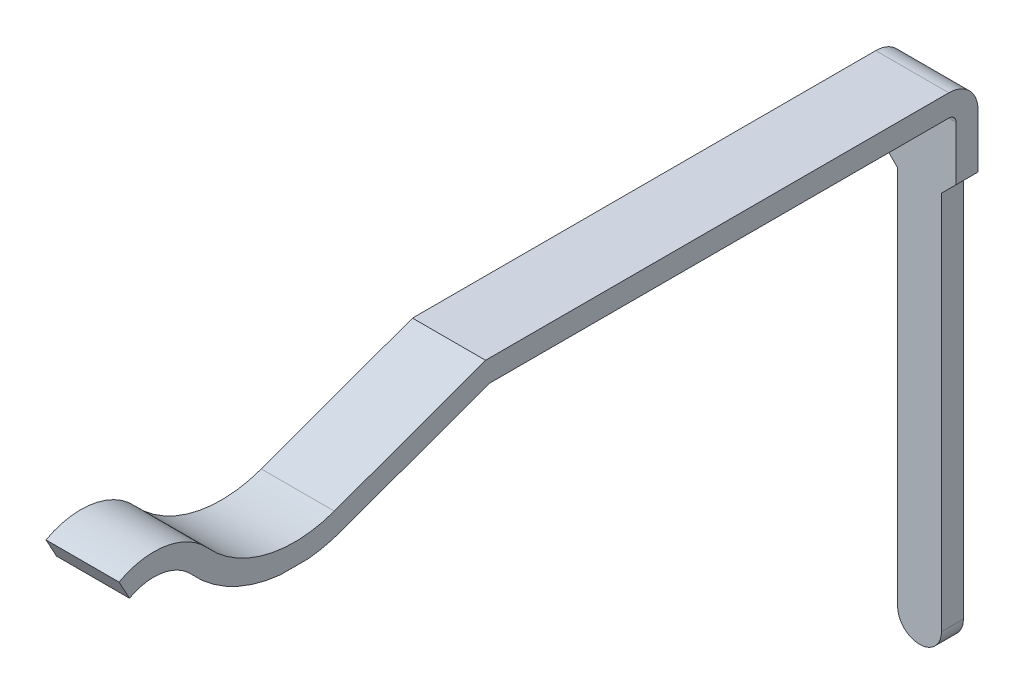
ISO-10303-21;
HEADER;
FILE_DESCRIPTION(('STEP AP214'),'2;1');
FILE_NAME('part.step','',(''),(''),'','','');
FILE_SCHEMA(('AUTOMOTIVE_DESIGN { 1 0 10303 214 1 1 1 1 }'));
ENDSEC;
DATA;
#1=APPLICATION_CONTEXT('core data for automotive mechanical design processes');
#2=APPLICATION_PROTOCOL_DEFINITION('international standard','automotive_design',2000,#1);
#3=PRODUCT_CONTEXT('',#1,'mechanical');
#4=PRODUCT('Part','Part','',(#3));
#5=PRODUCT_RELATED_PRODUCT_CATEGORY('part','',(#4));
#6=PRODUCT_DEFINITION_FORMATION('','',#4);
#7=PRODUCT_DEFINITION_CONTEXT('part definition',#1,'design');
#8=PRODUCT_DEFINITION('design','',#6,#7);
#9=PRODUCT_DEFINITION_SHAPE('','',#8);
#10=(LENGTH_UNIT() NAMED_UNIT(*) SI_UNIT(.MILLI.,.METRE.));
#11=(NAMED_UNIT(*) PLANE_ANGLE_UNIT() SI_UNIT($,.RADIAN.));
#12=(NAMED_UNIT(*) SI_UNIT($,.STERADIAN.) SOLID_ANGLE_UNIT());
#13=UNCERTAINTY_MEASURE_WITH_UNIT(LENGTH_MEASURE(1.E-05),#10,'distance_accuracy_value','');
#14=(GEOMETRIC_REPRESENTATION_CONTEXT(3) GLOBAL_UNCERTAINTY_ASSIGNED_CONTEXT((#13)) GLOBAL_UNIT_ASSIGNED_CONTEXT((#10,
#11,#12)) REPRESENTATION_CONTEXT('',''));
#15=CARTESIAN_POINT('',(0.,0.,0.));
#16=DIRECTION('',(0.,0.,1.));
#17=DIRECTION('',(1.,0.,0.));
#18=AXIS2_PLACEMENT_3D('',#15,#16,#17);
#19=CARTESIAN_POINT('',(0.5,-0.4,-12.46));
#20=DIRECTION('',(0.,0.,-1.));
#21=DIRECTION('',(0.,1.,0.));
#22=AXIS2_PLACEMENT_3D('',#19,#20,#21);
#23=PLANE('',#22);
#24=DIRECTION('',(0.,1.,0.));
#25=VECTOR('',#24,1.);
#26=CARTESIAN_POINT('',(0.3,-0.4,-12.46));
#27=LINE('',#26,#25);
#28=CARTESIAN_POINT('',(0.3,-6.54,-12.46));
#29=VERTEX_POINT('',#28);
#30=CARTESIAN_POINT('',(0.3,-1.34,-12.46));
#31=VERTEX_POINT('',#30);
#32=EDGE_CURVE('E204',#29,#31,#27,.T.);
#33=ORIENTED_EDGE('',*,*,#32,.T.);
#34=DIRECTION('',(0.707106781186551,0.707106781186544,0.));
#35=VECTOR('',#34,1.);
#36=CARTESIAN_POINT('',(0.87,-0.77,-12.46));
#37=LINE('',#36,#35);
#38=CARTESIAN_POINT('',(0.5,-1.14,-12.46));
#39=VERTEX_POINT('',#38);
#40=EDGE_CURVE('E199',#31,#39,#37,.T.);
#41=ORIENTED_EDGE('',*,*,#40,.T.);
#42=DIRECTION('',(0.,-1.,0.));
#43=VECTOR('',#42,1.);
#44=CARTESIAN_POINT('',(0.5,-0.4,-12.46));
#45=LINE('',#44,#43);
#46=CARTESIAN_POINT('',(0.5,-0.4,-12.46));
#47=VERTEX_POINT('',#46);
#48=EDGE_CURVE('E209',#47,#39,#45,.T.);
#49=ORIENTED_EDGE('',*,*,#48,.F.);
#50=DIRECTION('',(-1.,0.,0.));
#51=VECTOR('',#50,1.);
#52=CARTESIAN_POINT('',(0.5,-0.4,-12.46));
#53=LINE('',#52,#51);
#54=CARTESIAN_POINT('',(-0.5,-0.4,-12.46));
#55=VERTEX_POINT('',#54);
#56=EDGE_CURVE('E246',#47,#55,#53,.T.);
#57=ORIENTED_EDGE('',*,*,#56,.T.);
#58=DIRECTION('',(0.,-1.,0.));
#59=VECTOR('',#58,1.);
#60=CARTESIAN_POINT('',(-0.5,-0.4,-12.46));
#61=LINE('',#60,#59);
#62=CARTESIAN_POINT('',(-0.5,-1.14,-12.46));
#63=VERTEX_POINT('',#62);
#64=EDGE_CURVE('E208',#55,#63,#61,.T.);
#65=ORIENTED_EDGE('',*,*,#64,.T.);
#66=DIRECTION('',(0.707106781186544,-0.707106781186552,0.));
#67=VECTOR('',#66,1.);
#68=CARTESIAN_POINT('',(-0.370000000000004,-1.27,-12.46));
#69=LINE('',#68,#67);
#70=CARTESIAN_POINT('',(-0.3,-1.34,-12.46));
#71=VERTEX_POINT('',#70);
#72=EDGE_CURVE('E195',#63,#71,#69,.T.);
#73=ORIENTED_EDGE('',*,*,#72,.T.);
#74=DIRECTION('',(0.,-1.,0.));
#75=VECTOR('',#74,1.);
#76=CARTESIAN_POINT('',(-0.3,-0.4,-12.46));
#77=LINE('',#76,#75);
#78=CARTESIAN_POINT('',(-0.3,-6.54,-12.46));
#79=VERTEX_POINT('',#78);
#80=EDGE_CURVE('E202',#71,#79,#77,.T.);
#81=ORIENTED_EDGE('',*,*,#80,.T.);
#82=CARTESIAN_POINT('',(0.,-6.54,-12.46));
#83=DIRECTION('',(0.,0.,-1.));
#84=DIRECTION('',(0.,1.,0.));
#85=AXIS2_PLACEMENT_3D('',#82,#83,#84);
#86=CIRCLE('',#85,0.3);
#87=EDGE_CURVE('E158',#79,#29,#86,.F.);
#88=ORIENTED_EDGE('',*,*,#87,.T.);
#89=EDGE_LOOP('',(#33,#41,#49,#57,#65,#73,#81,#88));
#90=FACE_BOUND('',#89,.T.);
#91=ADVANCED_FACE('F17',(#90),#23,.F.);
#92=CARTESIAN_POINT('',(0.5,-0.4,-12.76));
#93=DIRECTION('',(0.,0.,-1.));
#94=DIRECTION('',(0.,1.,0.));
#95=AXIS2_PLACEMENT_3D('',#92,#93,#94);
#96=PLANE('',#95);
#97=DIRECTION('',(-0.707106781186551,-0.707106781186544,0.));
#98=VECTOR('',#97,1.);
#99=CARTESIAN_POINT('',(0.5,-1.14,-12.76));
#100=LINE('',#99,#98);
#101=CARTESIAN_POINT('',(0.5,-1.14,-12.76));
#102=VERTEX_POINT('',#101);
#103=CARTESIAN_POINT('',(0.3,-1.34,-12.76));
#104=VERTEX_POINT('',#103);
#105=EDGE_CURVE('E180',#102,#104,#100,.T.);
#106=ORIENTED_EDGE('',*,*,#105,.T.);
#107=DIRECTION('',(0.,-1.,0.));
#108=VECTOR('',#107,1.);
#109=CARTESIAN_POINT('',(0.3,-1.34,-12.76));
#110=LINE('',#109,#108);
#111=CARTESIAN_POINT('',(0.3,-6.54,-12.76));
#112=VERTEX_POINT('',#111);
#113=EDGE_CURVE('E162',#104,#112,#110,.T.);
#114=ORIENTED_EDGE('',*,*,#113,.T.);
#115=CARTESIAN_POINT('',(0.,-6.54,-12.76));
#116=DIRECTION('',(0.,0.,-1.));
#117=DIRECTION('',(1.,0.,0.));
#118=AXIS2_PLACEMENT_3D('',#115,#116,#117);
#119=CIRCLE('',#118,0.3);
#120=CARTESIAN_POINT('',(-0.3,-6.54,-12.76));
#121=VERTEX_POINT('',#120);
#122=EDGE_CURVE('E156',#112,#121,#119,.T.);
#123=ORIENTED_EDGE('',*,*,#122,.T.);
#124=DIRECTION('',(0.,1.,0.));
#125=VECTOR('',#124,1.);
#126=CARTESIAN_POINT('',(-0.3,-6.54,-12.76));
#127=LINE('',#126,#125);
#128=CARTESIAN_POINT('',(-0.3,-1.34,-12.76));
#129=VERTEX_POINT('',#128);
#130=EDGE_CURVE('E165',#121,#129,#127,.T.);
#131=ORIENTED_EDGE('',*,*,#130,.T.);
#132=DIRECTION('',(-0.707106781186544,0.707106781186551,0.));
#133=VECTOR('',#132,1.);
#134=CARTESIAN_POINT('',(-0.3,-1.34,-12.76));
#135=LINE('',#134,#133);
#136=CARTESIAN_POINT('',(-0.5,-1.14,-12.76));
#137=VERTEX_POINT('',#136);
#138=EDGE_CURVE('E171',#129,#137,#135,.T.);
#139=ORIENTED_EDGE('',*,*,#138,.T.);
#140=DIRECTION('',(0.,-1.,0.));
#141=VECTOR('',#140,1.);
#142=CARTESIAN_POINT('',(-0.5,-0.4,-12.76));
#143=LINE('',#142,#141);
#144=CARTESIAN_POINT('',(-0.5,-0.4,-12.76));
#145=VERTEX_POINT('',#144);
#146=EDGE_CURVE('E249',#145,#137,#143,.T.);
#147=ORIENTED_EDGE('',*,*,#146,.F.);
#148=DIRECTION('',(-1.,0.,0.));
#149=VECTOR('',#148,1.);
#150=CARTESIAN_POINT('',(0.5,-0.4,-12.76));
#151=LINE('',#150,#149);
#152=CARTESIAN_POINT('',(0.5,-0.4,-12.76));
#153=VERTEX_POINT('',#152);
#154=EDGE_CURVE('E307',#153,#145,#151,.T.);
#155=ORIENTED_EDGE('',*,*,#154,.F.);
#156=DIRECTION('',(0.,-1.,0.));
#157=VECTOR('',#156,1.);
#158=CARTESIAN_POINT('',(0.5,-0.4,-12.76));
#159=LINE('',#158,#157);
#160=EDGE_CURVE('E212',#153,#102,#159,.T.);
#161=ORIENTED_EDGE('',*,*,#160,.T.);
#162=EDGE_LOOP('',(#106,#114,#123,#131,#139,#147,#155,#161));
#163=FACE_BOUND('',#162,.T.);
#164=ADVANCED_FACE('F175',(#163),#96,.T.);
#165=CARTESIAN_POINT('',(0.5,-0.4,-12.36));
#166=DIRECTION('',(-1.,0.,0.));
#167=DIRECTION('',(0.,0.,1.));
#168=AXIS2_PLACEMENT_3D('',#165,#166,#167);
#169=CYLINDRICAL_SURFACE('',#168,0.4);
#170=CARTESIAN_POINT('',(-0.5,-0.4,-12.36));
#171=DIRECTION('',(-1.,0.,0.));
#172=DIRECTION('',(0.,0.,1.));
#173=AXIS2_PLACEMENT_3D('',#170,#171,#172);
#174=CIRCLE('',#173,0.4);
#175=CARTESIAN_POINT('',(-0.5,0.,-12.36));
#176=VERTEX_POINT('',#175);
#177=EDGE_CURVE('E252',#176,#145,#174,.T.);
#178=ORIENTED_EDGE('',*,*,#177,.F.);
#179=DIRECTION('',(-1.,0.,0.));
#180=VECTOR('',#179,1.);
#181=CARTESIAN_POINT('',(0.5,0.,-12.36));
#182=LINE('',#181,#180);
#183=CARTESIAN_POINT('',(0.5,0.,-12.36));
#184=VERTEX_POINT('',#183);
#185=EDGE_CURVE('E305',#184,#176,#182,.T.);
#186=ORIENTED_EDGE('',*,*,#185,.F.);
#187=CARTESIAN_POINT('',(0.5,-0.4,-12.36));
#188=DIRECTION('',(-1.,0.,0.));
#189=DIRECTION('',(0.,0.,1.));
#190=AXIS2_PLACEMENT_3D('',#187,#188,#189);
#191=CIRCLE('',#190,0.4);
#192=EDGE_CURVE('E216',#184,#153,#191,.T.);
#193=ORIENTED_EDGE('',*,*,#192,.T.);
#194=ORIENTED_EDGE('',*,*,#154,.T.);
#195=EDGE_LOOP('',(#178,#186,#193,#194));
#196=FACE_BOUND('',#195,.T.);
#197=ADVANCED_FACE('F361',(#196),#169,.T.);
#198=CARTESIAN_POINT('',(0.5,0.,-6.01747897566997));
#199=DIRECTION('',(0.,1.,0.));
#200=DIRECTION('',(0.,0.,1.));
#201=AXIS2_PLACEMENT_3D('',#198,#199,#200);
#202=PLANE('',#201);
#203=DIRECTION('',(0.,0.,-1.));
#204=VECTOR('',#203,1.);
#205=CARTESIAN_POINT('',(-0.5,0.,-6.01747897566997));
#206=LINE('',#205,#204);
#207=CARTESIAN_POINT('',(-0.5,0.,-6.01747897566997));
#208=VERTEX_POINT('',#207);
#209=EDGE_CURVE('E255',#208,#176,#206,.T.);
#210=ORIENTED_EDGE('',*,*,#209,.F.);
#211=DIRECTION('',(-1.,0.,0.));
#212=VECTOR('',#211,1.);
#213=CARTESIAN_POINT('',(0.5,0.,-6.01747897566997));
#214=LINE('',#213,#212);
#215=CARTESIAN_POINT('',(0.5,0.,-6.01747897566997));
#216=VERTEX_POINT('',#215);
#217=EDGE_CURVE('E303',#216,#208,#214,.T.);
#218=ORIENTED_EDGE('',*,*,#217,.F.);
#219=DIRECTION('',(0.,0.,-1.));
#220=VECTOR('',#219,1.);
#221=CARTESIAN_POINT('',(0.5,0.,-6.01747897566997));
#222=LINE('',#221,#220);
#223=EDGE_CURVE('E219',#216,#184,#222,.T.);
#224=ORIENTED_EDGE('',*,*,#223,.T.);
#225=ORIENTED_EDGE('',*,*,#185,.T.);
#226=EDGE_LOOP('',(#210,#218,#224,#225));
#227=FACE_BOUND('',#226,.T.);
#228=ADVANCED_FACE('F357',(#227),#202,.T.);
#229=CARTESIAN_POINT('',(0.5,0.,-6.01747897566997));
#230=DIRECTION('',(0.,0.939692620785908,0.342020143325669));
#231=DIRECTION('',(0.,-0.342020143325669,0.939692620785908));
#232=AXIS2_PLACEMENT_3D('',#229,#230,#231);
#233=PLANE('',#232);
#234=DIRECTION('',(0.,0.342020143325669,-0.939692620785908));
#235=VECTOR('',#234,1.);
#236=CARTESIAN_POINT('',(-0.5,0.,-6.01747897566997));
#237=LINE('',#236,#235);
#238=CARTESIAN_POINT('',(-0.5,-0.753508193257452,-3.94723222932108));
#239=VERTEX_POINT('',#238);
#240=EDGE_CURVE('E258',#239,#208,#237,.T.);
#241=ORIENTED_EDGE('',*,*,#240,.F.);
#242=DIRECTION('',(-1.,0.,0.));
#243=VECTOR('',#242,1.);
#244=CARTESIAN_POINT('',(0.5,-0.753508193257452,-3.94723222932108));
#245=LINE('',#244,#243);
#246=CARTESIAN_POINT('',(0.5,-0.753508193257452,-3.94723222932108));
#247=VERTEX_POINT('',#246);
#248=EDGE_CURVE('E301',#247,#239,#245,.T.);
#249=ORIENTED_EDGE('',*,*,#248,.F.);
#250=DIRECTION('',(0.,0.342020143325669,-0.939692620785908));
#251=VECTOR('',#250,1.);
#252=CARTESIAN_POINT('',(0.5,0.,-6.01747897566997));
#253=LINE('',#252,#251);
#254=EDGE_CURVE('E222',#247,#216,#253,.T.);
#255=ORIENTED_EDGE('',*,*,#254,.T.);
#256=ORIENTED_EDGE('',*,*,#217,.T.);
#257=EDGE_LOOP('',(#241,#249,#255,#256));
#258=FACE_BOUND('',#257,.T.);
#259=ADVANCED_FACE('F353',(#258),#233,.T.);
#260=CARTESIAN_POINT('',(0.5,0.75,-3.4));
#261=DIRECTION('',(-1.,0.,0.));
#262=DIRECTION('',(0.,0.,1.));
#263=AXIS2_PLACEMENT_3D('',#260,#261,#262);
#264=CYLINDRICAL_SURFACE('',#263,1.6);
#265=CARTESIAN_POINT('',(-0.5,0.75,-3.4));
#266=DIRECTION('',(1.,0.,0.));
#267=DIRECTION('',(0.,0.,1.));
#268=AXIS2_PLACEMENT_3D('',#265,#266,#267);
#269=CIRCLE('',#268,1.6);
#270=CARTESIAN_POINT('',(-0.5,-0.326923076923077,-2.21668402935204));
#271=VERTEX_POINT('',#270);
#272=EDGE_CURVE('E261',#271,#239,#269,.T.);
#273=ORIENTED_EDGE('',*,*,#272,.F.);
#274=DIRECTION('',(-1.,0.,0.));
#275=VECTOR('',#274,1.);
#276=CARTESIAN_POINT('',(0.5,-0.326923076923077,-2.21668402935204));
#277=LINE('',#276,#275);
#278=CARTESIAN_POINT('',(0.5,-0.326923076923077,-2.21668402935204));
#279=VERTEX_POINT('',#278);
#280=EDGE_CURVE('E299',#279,#271,#277,.T.);
#281=ORIENTED_EDGE('',*,*,#280,.F.);
#282=CARTESIAN_POINT('',(0.5,0.75,-3.4));
#283=DIRECTION('',(1.,0.,0.));
#284=DIRECTION('',(0.,0.,1.));
#285=AXIS2_PLACEMENT_3D('',#282,#283,#284);
#286=CIRCLE('',#285,1.6);
#287=EDGE_CURVE('E225',#279,#247,#286,.T.);
#288=ORIENTED_EDGE('',*,*,#287,.T.);
#289=ORIENTED_EDGE('',*,*,#248,.T.);
#290=EDGE_LOOP('',(#273,#281,#288,#289));
#291=FACE_BOUND('',#290,.T.);
#292=ADVANCED_FACE('F349',(#291),#264,.F.);
#293=CARTESIAN_POINT('',(0.5,-1.,-1.47711154769706));
#294=DIRECTION('',(-1.,0.,0.));
#295=DIRECTION('',(0.,0.,1.));
#296=AXIS2_PLACEMENT_3D('',#293,#294,#295);
#297=CYLINDRICAL_SURFACE('',#296,1.);
#298=CARTESIAN_POINT('',(-0.5,-1.,-1.47711154769706));
#299=DIRECTION('',(-1.,0.,0.));
#300=DIRECTION('',(0.,0.,-1.));
#301=AXIS2_PLACEMENT_3D('',#298,#299,#300);
#302=CIRCLE('',#301,1.);
#303=CARTESIAN_POINT('',(-0.5,-0.121157254650118,-1.));
#304=VERTEX_POINT('',#303);
#305=EDGE_CURVE('E264',#304,#271,#302,.T.);
#306=ORIENTED_EDGE('',*,*,#305,.F.);
#307=DIRECTION('',(-1.,0.,0.));
#308=VECTOR('',#307,1.);
#309=CARTESIAN_POINT('',(0.5,-0.121157254650118,-1.));
#310=LINE('',#309,#308);
#311=CARTESIAN_POINT('',(0.5,-0.121157254650118,-1.));
#312=VERTEX_POINT('',#311);
#313=EDGE_CURVE('E297',#312,#304,#310,.T.);
#314=ORIENTED_EDGE('',*,*,#313,.F.);
#315=CARTESIAN_POINT('',(0.5,-1.,-1.47711154769706));
#316=DIRECTION('',(-1.,0.,0.));
#317=DIRECTION('',(0.,0.,-1.));
#318=AXIS2_PLACEMENT_3D('',#315,#316,#317);
#319=CIRCLE('',#318,1.);
#320=EDGE_CURVE('E228',#312,#279,#319,.T.);
#321=ORIENTED_EDGE('',*,*,#320,.T.);
#322=ORIENTED_EDGE('',*,*,#280,.T.);
#323=EDGE_LOOP('',(#306,#314,#321,#322));
#324=FACE_BOUND('',#323,.T.);
#325=ADVANCED_FACE('F345',(#324),#297,.T.);
#326=CARTESIAN_POINT('',(0.5,-0.384810078255083,-1.14313346430912));
#327=DIRECTION('',(0.,-0.477111547697059,0.878842745349882));
#328=DIRECTION('',(0.,-0.878842745349882,-0.477111547697059));
#329=AXIS2_PLACEMENT_3D('',#326,#327,#328);
#330=PLANE('',#329);
#331=DIRECTION('',(0.,0.878842745349882,0.477111547697059));
#332=VECTOR('',#331,1.);
#333=CARTESIAN_POINT('',(-0.5,-0.384810078255083,-1.14313346430912));
#334=LINE('',#333,#332);
#335=CARTESIAN_POINT('',(-0.5,-0.384810078255083,-1.14313346430912));
#336=VERTEX_POINT('',#335);
#337=EDGE_CURVE('E267',#336,#304,#334,.T.);
#338=ORIENTED_EDGE('',*,*,#337,.F.);
#339=DIRECTION('',(-1.,0.,0.));
#340=VECTOR('',#339,1.);
#341=CARTESIAN_POINT('',(0.5,-0.384810078255083,-1.14313346430912));
#342=LINE('',#341,#340);
#343=CARTESIAN_POINT('',(0.5,-0.384810078255083,-1.14313346430912));
#344=VERTEX_POINT('',#343);
#345=EDGE_CURVE('E295',#344,#336,#342,.T.);
#346=ORIENTED_EDGE('',*,*,#345,.F.);
#347=DIRECTION('',(0.,0.878842745349882,0.477111547697059));
#348=VECTOR('',#347,1.);
#349=CARTESIAN_POINT('',(0.5,-0.384810078255083,-1.14313346430912));
#350=LINE('',#349,#348);
#351=EDGE_CURVE('E231',#344,#312,#350,.T.);
#352=ORIENTED_EDGE('',*,*,#351,.T.);
#353=ORIENTED_EDGE('',*,*,#313,.T.);
#354=EDGE_LOOP('',(#338,#346,#352,#353));
#355=FACE_BOUND('',#354,.T.);
#356=ADVANCED_FACE('F342',(#355),#330,.T.);
#357=CARTESIAN_POINT('',(0.5,-1.,-1.47711154769706));
#358=DIRECTION('',(-1.,0.,0.));
#359=DIRECTION('',(0.,0.,1.));
#360=AXIS2_PLACEMENT_3D('',#357,#358,#359);
#361=CYLINDRICAL_SURFACE('',#360,0.7);
#362=CARTESIAN_POINT('',(-0.5,-1.,-1.47711154769706));
#363=DIRECTION('',(1.,0.,0.));
#364=DIRECTION('',(0.,0.,-1.));
#365=AXIS2_PLACEMENT_3D('',#362,#363,#364);
#366=CIRCLE('',#365,0.7);
#367=CARTESIAN_POINT('',(-0.5,-0.528846153846154,-1.99481228485554));
#368=VERTEX_POINT('',#367);
#369=EDGE_CURVE('E270',#336,#368,#366,.F.);
#370=ORIENTED_EDGE('',*,*,#369,.T.);
#371=DIRECTION('',(-1.,0.,0.));
#372=VECTOR('',#371,1.);
#373=CARTESIAN_POINT('',(0.5,-0.528846153846154,-1.99481228485554));
#374=LINE('',#373,#372);
#375=CARTESIAN_POINT('',(0.5,-0.528846153846154,-1.99481228485554));
#376=VERTEX_POINT('',#375);
#377=EDGE_CURVE('E292',#376,#368,#374,.T.);
#378=ORIENTED_EDGE('',*,*,#377,.F.);
#379=CARTESIAN_POINT('',(0.5,-1.,-1.47711154769706));
#380=DIRECTION('',(1.,0.,0.));
#381=DIRECTION('',(0.,0.,-1.));
#382=AXIS2_PLACEMENT_3D('',#379,#380,#381);
#383=CIRCLE('',#382,0.7);
#384=EDGE_CURVE('E234',#344,#376,#383,.F.);
#385=ORIENTED_EDGE('',*,*,#384,.F.);
#386=ORIENTED_EDGE('',*,*,#345,.T.);
#387=EDGE_LOOP('',(#370,#378,#385,#386));
#388=FACE_BOUND('',#387,.T.);
#389=ADVANCED_FACE('F338',(#388),#361,.F.);
#390=CARTESIAN_POINT('',(0.5,0.75,-3.4));
#391=DIRECTION('',(-1.,0.,0.));
#392=DIRECTION('',(0.,0.,1.));
#393=AXIS2_PLACEMENT_3D('',#390,#391,#392);
#394=CYLINDRICAL_SURFACE('',#393,1.9);
#395=CARTESIAN_POINT('',(0.5,0.75,-3.4));
#396=DIRECTION('',(1.,0.,0.));
#397=DIRECTION('',(0.,0.,-1.));
#398=AXIS2_PLACEMENT_3D('',#395,#396,#397);
#399=CIRCLE('',#398,1.9);
#400=CARTESIAN_POINT('',(0.5,-1.14,-3.59467922333929));
#401=VERTEX_POINT('',#400);
#402=CARTESIAN_POINT('',(0.5,-1.03541597949322,-4.04983827231877));
#403=VERTEX_POINT('',#402);
#404=EDGE_CURVE('E236',#401,#403,#399,.T.);
#405=ORIENTED_EDGE('',*,*,#404,.F.);
#406=CARTESIAN_POINT('',(2.39000000000003,0.75,-3.4));
#407=DIRECTION('',(-0.707106781186544,0.707106781186551,0.));
#408=DIRECTION('',(-0.707106781186551,-0.707106781186544,0.));
#409=AXIS2_PLACEMENT_3D('',#406,#407,#408);
#410=ELLIPSE('',#409,2.6870057685089,1.9);
#411=CARTESIAN_POINT('',(0.5,-1.14,-3.20532077666071));
#412=VERTEX_POINT('',#411);
#413=EDGE_CURVE('E30',#401,#412,#410,.T.);
#414=ORIENTED_EDGE('',*,*,#413,.T.);
#415=EDGE_CURVE('E237',#376,#412,#399,.T.);
#416=ORIENTED_EDGE('',*,*,#415,.F.);
#417=ORIENTED_EDGE('',*,*,#377,.T.);
#418=CARTESIAN_POINT('',(-0.5,0.75,-3.4));
#419=DIRECTION('',(1.,0.,0.));
#420=DIRECTION('',(0.,0.,-1.));
#421=AXIS2_PLACEMENT_3D('',#418,#419,#420);
#422=CIRCLE('',#421,1.9);
#423=CARTESIAN_POINT('',(-0.5,-1.14,-3.20532077666066));
#424=VERTEX_POINT('',#423);
#425=EDGE_CURVE('E273',#368,#424,#422,.T.);
#426=ORIENTED_EDGE('',*,*,#425,.T.);
#427=CARTESIAN_POINT('',(-2.39,0.75,-3.4));
#428=DIRECTION('',(0.707106781186552,0.707106781186544,0.));
#429=DIRECTION('',(-0.707106781186544,0.707106781186552,0.));
#430=AXIS2_PLACEMENT_3D('',#427,#428,#429);
#431=ELLIPSE('',#430,2.68700576850887,1.9);
#432=CARTESIAN_POINT('',(-0.5,-1.14,-3.59467922333934));
#433=VERTEX_POINT('',#432);
#434=EDGE_CURVE('E36',#424,#433,#431,.T.);
#435=ORIENTED_EDGE('',*,*,#434,.T.);
#436=CARTESIAN_POINT('',(-0.5,-1.03541597949322,-4.04983827231877));
#437=VERTEX_POINT('',#436);
#438=EDGE_CURVE('E272',#433,#437,#422,.T.);
#439=ORIENTED_EDGE('',*,*,#438,.T.);
#440=DIRECTION('',(-1.,0.,0.));
#441=VECTOR('',#440,1.);
#442=CARTESIAN_POINT('',(0.5,-1.03541597949322,-4.04983827231877));
#443=LINE('',#442,#441);
#444=EDGE_CURVE('E289',#403,#437,#443,.T.);
#445=ORIENTED_EDGE('',*,*,#444,.F.);
#446=EDGE_LOOP('',(#405,#414,#416,#417,#426,#435,#439,#445));
#447=FACE_BOUND('',#446,.T.);
#448=ADVANCED_FACE('F314',(#447),#394,.T.);
#449=CARTESIAN_POINT('',(0.5,-0.281907786235773,-6.12008501866767));
#450=DIRECTION('',(0.,0.939692620785908,0.342020143325669));
#451=DIRECTION('',(0.,-0.342020143325669,0.939692620785908));
#452=AXIS2_PLACEMENT_3D('',#449,#450,#451);
#453=PLANE('',#452);
#454=DIRECTION('',(0.,0.342020143325669,-0.939692620785908));
#455=VECTOR('',#454,1.);
#456=CARTESIAN_POINT('',(-0.5,-0.281907786235773,-6.12008501866767));
#457=LINE('',#456,#455);
#458=CARTESIAN_POINT('',(-0.5,-0.3,-6.07037706988251));
#459=VERTEX_POINT('',#458);
#460=EDGE_CURVE('E276',#437,#459,#457,.T.);
#461=ORIENTED_EDGE('',*,*,#460,.T.);
#462=DIRECTION('',(-1.,0.,0.));
#463=VECTOR('',#462,1.);
#464=CARTESIAN_POINT('',(0.5,-0.3,-6.07037706988251));
#465=LINE('',#464,#463);
#466=CARTESIAN_POINT('',(0.5,-0.3,-6.07037706988251));
#467=VERTEX_POINT('',#466);
#468=EDGE_CURVE('E286',#467,#459,#465,.T.);
#469=ORIENTED_EDGE('',*,*,#468,.F.);
#470=DIRECTION('',(0.,0.342020143325669,-0.939692620785908));
#471=VECTOR('',#470,1.);
#472=CARTESIAN_POINT('',(0.5,-0.281907786235773,-6.12008501866767));
#473=LINE('',#472,#471);
#474=EDGE_CURVE('E240',#403,#467,#473,.T.);
#475=ORIENTED_EDGE('',*,*,#474,.F.);
#476=ORIENTED_EDGE('',*,*,#444,.T.);
#477=EDGE_LOOP('',(#461,#469,#475,#476));
#478=FACE_BOUND('',#477,.T.);
#479=ADVANCED_FACE('F322',(#478),#453,.F.);
#480=CARTESIAN_POINT('',(0.5,-0.3,-6.01747897566997));
#481=DIRECTION('',(0.,1.,0.));
#482=DIRECTION('',(0.,0.,1.));
#483=AXIS2_PLACEMENT_3D('',#480,#481,#482);
#484=PLANE('',#483);
#485=DIRECTION('',(0.,0.,-1.));
#486=VECTOR('',#485,1.);
#487=CARTESIAN_POINT('',(-0.5,-0.3,-6.01747897566997));
#488=LINE('',#487,#486);
#489=CARTESIAN_POINT('',(-0.5,-0.3,-12.36));
#490=VERTEX_POINT('',#489);
#491=EDGE_CURVE('E278',#459,#490,#488,.T.);
#492=ORIENTED_EDGE('',*,*,#491,.T.);
#493=DIRECTION('',(-1.,0.,0.));
#494=VECTOR('',#493,1.);
#495=CARTESIAN_POINT('',(0.5,-0.3,-12.36));
#496=LINE('',#495,#494);
#497=CARTESIAN_POINT('',(0.5,-0.3,-12.36));
#498=VERTEX_POINT('',#497);
#499=EDGE_CURVE('E283',#498,#490,#496,.T.);
#500=ORIENTED_EDGE('',*,*,#499,.F.);
#501=DIRECTION('',(0.,0.,-1.));
#502=VECTOR('',#501,1.);
#503=CARTESIAN_POINT('',(0.5,-0.3,-6.01747897566997));
#504=LINE('',#503,#502);
#505=EDGE_CURVE('E242',#467,#498,#504,.T.);
#506=ORIENTED_EDGE('',*,*,#505,.F.);
#507=ORIENTED_EDGE('',*,*,#468,.T.);
#508=EDGE_LOOP('',(#492,#500,#506,#507));
#509=FACE_BOUND('',#508,.T.);
#510=ADVANCED_FACE('F326',(#509),#484,.F.);
#511=CARTESIAN_POINT('',(0.5,-0.4,-12.36));
#512=DIRECTION('',(-1.,0.,0.));
#513=DIRECTION('',(0.,0.,1.));
#514=AXIS2_PLACEMENT_3D('',#511,#512,#513);
#515=CYLINDRICAL_SURFACE('',#514,0.1);
#516=CARTESIAN_POINT('',(-0.5,-0.4,-12.36));
#517=DIRECTION('',(1.,0.,0.));
#518=DIRECTION('',(0.,0.,-1.));
#519=AXIS2_PLACEMENT_3D('',#516,#517,#518);
#520=CIRCLE('',#519,0.1);
#521=EDGE_CURVE('E213',#490,#55,#520,.F.);
#522=ORIENTED_EDGE('',*,*,#521,.T.);
#523=ORIENTED_EDGE('',*,*,#56,.F.);
#524=CARTESIAN_POINT('',(0.5,-0.4,-12.36));
#525=DIRECTION('',(1.,0.,0.));
#526=DIRECTION('',(0.,0.,-1.));
#527=AXIS2_PLACEMENT_3D('',#524,#525,#526);
#528=CIRCLE('',#527,0.1);
#529=EDGE_CURVE('E244',#498,#47,#528,.F.);
#530=ORIENTED_EDGE('',*,*,#529,.F.);
#531=ORIENTED_EDGE('',*,*,#499,.T.);
#532=EDGE_LOOP('',(#522,#523,#530,#531));
#533=FACE_BOUND('',#532,.T.);
#534=ADVANCED_FACE('F370',(#533),#515,.F.);
#535=CARTESIAN_POINT('',(0.5,-0.4,-12.36));
#536=DIRECTION('',(-1.,0.,0.));
#537=DIRECTION('',(0.,0.,1.));
#538=AXIS2_PLACEMENT_3D('',#535,#536,#537);
#539=PLANE('',#538);
#540=ORIENTED_EDGE('',*,*,#415,.T.);
#541=DIRECTION('',(0.,0.,-1.));
#542=VECTOR('',#541,1.);
#543=CARTESIAN_POINT('',(0.5,-1.14,-12.36));
#544=LINE('',#543,#542);
#545=EDGE_CURVE('E11',#412,#401,#544,.T.);
#546=ORIENTED_EDGE('',*,*,#545,.T.);
#547=ORIENTED_EDGE('',*,*,#404,.T.);
#548=ORIENTED_EDGE('',*,*,#474,.T.);
#549=ORIENTED_EDGE('',*,*,#505,.T.);
#550=ORIENTED_EDGE('',*,*,#529,.T.);
#551=ORIENTED_EDGE('',*,*,#48,.T.);
#552=DIRECTION('',(0.,0.,1.));
#553=VECTOR('',#552,1.);
#554=CARTESIAN_POINT('',(0.5,-1.14,-12.76));
#555=LINE('',#554,#553);
#556=EDGE_CURVE('E188',#102,#39,#555,.T.);
#557=ORIENTED_EDGE('',*,*,#556,.F.);
#558=ORIENTED_EDGE('',*,*,#160,.F.);
#559=ORIENTED_EDGE('',*,*,#192,.F.);
#560=ORIENTED_EDGE('',*,*,#223,.F.);
#561=ORIENTED_EDGE('',*,*,#254,.F.);
#562=ORIENTED_EDGE('',*,*,#287,.F.);
#563=ORIENTED_EDGE('',*,*,#320,.F.);
#564=ORIENTED_EDGE('',*,*,#351,.F.);
#565=ORIENTED_EDGE('',*,*,#384,.T.);
#566=EDGE_LOOP('',(#540,#546,#547,#548,#549,#550,#551,#557,#558,#559,#560,#561,#562,#563,#564,#565));
#567=FACE_BOUND('',#566,.T.);
#568=ADVANCED_FACE('F330',(#567),#539,.F.);
#569=CARTESIAN_POINT('',(-0.5,-0.4,-12.36));
#570=DIRECTION('',(-1.,0.,0.));
#571=DIRECTION('',(0.,0.,1.));
#572=AXIS2_PLACEMENT_3D('',#569,#570,#571);
#573=PLANE('',#572);
#574=DIRECTION('',(0.,0.,-1.));
#575=VECTOR('',#574,1.);
#576=CARTESIAN_POINT('',(-0.5,-1.14,-12.36));
#577=LINE('',#576,#575);
#578=EDGE_CURVE('E24',#424,#433,#577,.T.);
#579=ORIENTED_EDGE('',*,*,#578,.F.);
#580=ORIENTED_EDGE('',*,*,#425,.F.);
#581=ORIENTED_EDGE('',*,*,#369,.F.);
#582=ORIENTED_EDGE('',*,*,#337,.T.);
#583=ORIENTED_EDGE('',*,*,#305,.T.);
#584=ORIENTED_EDGE('',*,*,#272,.T.);
#585=ORIENTED_EDGE('',*,*,#240,.T.);
#586=ORIENTED_EDGE('',*,*,#209,.T.);
#587=ORIENTED_EDGE('',*,*,#177,.T.);
#588=ORIENTED_EDGE('',*,*,#146,.T.);
#589=DIRECTION('',(0.,0.,1.));
#590=VECTOR('',#589,1.);
#591=CARTESIAN_POINT('',(-0.5,-1.14,-12.76));
#592=LINE('',#591,#590);
#593=EDGE_CURVE('E190',#137,#63,#592,.T.);
#594=ORIENTED_EDGE('',*,*,#593,.T.);
#595=ORIENTED_EDGE('',*,*,#64,.F.);
#596=ORIENTED_EDGE('',*,*,#521,.F.);
#597=ORIENTED_EDGE('',*,*,#491,.F.);
#598=ORIENTED_EDGE('',*,*,#460,.F.);
#599=ORIENTED_EDGE('',*,*,#438,.F.);
#600=EDGE_LOOP('',(#579,#580,#581,#582,#583,#584,#585,#586,#587,#588,#594,#595,#596,#597,#598,#599));
#601=FACE_BOUND('',#600,.T.);
#602=ADVANCED_FACE('F317',(#601),#573,.T.);
#603=CARTESIAN_POINT('',(0.5,-1.14,-12.76));
#604=DIRECTION('',(-0.707106781186544,0.707106781186551,0.));
#605=DIRECTION('',(-0.707106781186551,-0.707106781186544,0.));
#606=AXIS2_PLACEMENT_3D('',#603,#604,#605);
#607=PLANE('',#606);
#608=DIRECTION('',(0.,0.,1.));
#609=VECTOR('',#608,1.);
#610=CARTESIAN_POINT('',(0.3,-1.34,-12.76));
#611=LINE('',#610,#609);
#612=EDGE_CURVE('E185',#104,#31,#611,.T.);
#613=ORIENTED_EDGE('',*,*,#612,.F.);
#614=ORIENTED_EDGE('',*,*,#105,.F.);
#615=ORIENTED_EDGE('',*,*,#556,.T.);
#616=ORIENTED_EDGE('',*,*,#40,.F.);
#617=EDGE_LOOP('',(#613,#614,#615,#616));
#618=FACE_BOUND('',#617,.T.);
#619=ADVANCED_FACE('F440',(#618),#607,.F.);
#620=CARTESIAN_POINT('',(0.3,-1.34,-12.76));
#621=DIRECTION('',(-1.,0.,0.));
#622=DIRECTION('',(0.,-1.,0.));
#623=AXIS2_PLACEMENT_3D('',#620,#621,#622);
#624=PLANE('',#623);
#625=DIRECTION('',(0.,0.,1.));
#626=VECTOR('',#625,1.);
#627=CARTESIAN_POINT('',(0.3,-6.54,-12.76));
#628=LINE('',#627,#626);
#629=EDGE_CURVE('E183',#112,#29,#628,.T.);
#630=ORIENTED_EDGE('',*,*,#629,.F.);
#631=ORIENTED_EDGE('',*,*,#113,.F.);
#632=ORIENTED_EDGE('',*,*,#612,.T.);
#633=ORIENTED_EDGE('',*,*,#32,.F.);
#634=EDGE_LOOP('',(#630,#631,#632,#633));
#635=FACE_BOUND('',#634,.T.);
#636=ADVANCED_FACE('F448',(#635),#624,.F.);
#637=CARTESIAN_POINT('',(-0.3,-1.34,-12.76));
#638=DIRECTION('',(0.707106781186552,0.707106781186544,0.));
#639=DIRECTION('',(-0.707106781186544,0.707106781186552,0.));
#640=AXIS2_PLACEMENT_3D('',#637,#638,#639);
#641=PLANE('',#640);
#642=ORIENTED_EDGE('',*,*,#593,.F.);
#643=ORIENTED_EDGE('',*,*,#138,.F.);
#644=DIRECTION('',(0.,0.,1.));
#645=VECTOR('',#644,1.);
#646=CARTESIAN_POINT('',(-0.3,-1.34,-12.76));
#647=LINE('',#646,#645);
#648=EDGE_CURVE('E161',#129,#71,#647,.T.);
#649=ORIENTED_EDGE('',*,*,#648,.T.);
#650=ORIENTED_EDGE('',*,*,#72,.F.);
#651=EDGE_LOOP('',(#642,#643,#649,#650));
#652=FACE_BOUND('',#651,.T.);
#653=ADVANCED_FACE('F365',(#652),#641,.F.);
#654=CARTESIAN_POINT('',(-0.3,-6.54,-12.76));
#655=DIRECTION('',(1.,0.,0.));
#656=DIRECTION('',(0.,1.,0.));
#657=AXIS2_PLACEMENT_3D('',#654,#655,#656);
#658=PLANE('',#657);
#659=ORIENTED_EDGE('',*,*,#648,.F.);
#660=ORIENTED_EDGE('',*,*,#130,.F.);
#661=DIRECTION('',(0.,0.,1.));
#662=VECTOR('',#661,1.);
#663=CARTESIAN_POINT('',(-0.3,-6.54,-12.76));
#664=LINE('',#663,#662);
#665=EDGE_CURVE('E151',#121,#79,#664,.T.);
#666=ORIENTED_EDGE('',*,*,#665,.T.);
#667=ORIENTED_EDGE('',*,*,#80,.F.);
#668=EDGE_LOOP('',(#659,#660,#666,#667));
#669=FACE_BOUND('',#668,.T.);
#670=ADVANCED_FACE('F166',(#669),#658,.F.);
#671=CARTESIAN_POINT('',(0.,-6.54,-12.76));
#672=DIRECTION('',(0.,0.,1.));
#673=DIRECTION('',(1.,0.,0.));
#674=AXIS2_PLACEMENT_3D('',#671,#672,#673);
#675=CYLINDRICAL_SURFACE('',#674,0.3);
#676=ORIENTED_EDGE('',*,*,#665,.F.);
#677=ORIENTED_EDGE('',*,*,#122,.F.);
#678=ORIENTED_EDGE('',*,*,#629,.T.);
#679=ORIENTED_EDGE('',*,*,#87,.F.);
#680=EDGE_LOOP('',(#676,#677,#678,#679));
#681=FACE_BOUND('',#680,.T.);
#682=ADVANCED_FACE('F153',(#681),#675,.T.);
#683=ORIENTED_EDGE('',*,*,#578,.T.);
#684=ORIENTED_EDGE('',*,*,#434,.F.);
#685=EDGE_LOOP('',(#683,#684));
#686=FACE_BOUND('',#685,.T.);
#687=ADVANCED_FACE('F308',(#686),#641,.F.);
#688=ORIENTED_EDGE('',*,*,#545,.F.);
#689=ORIENTED_EDGE('',*,*,#413,.F.);
#690=EDGE_LOOP('',(#688,#689));
#691=FACE_BOUND('',#690,.T.);
#692=ADVANCED_FACE('F451',(#691),#607,.F.);
#693=CLOSED_SHELL('',(#91,#164,#197,#228,#259,#292,#325,#356,#389,#448,#479,#510,#534,#568,#602,
#619,#636,#653,#670,#682,#687,#692));
#694=MANIFOLD_SOLID_BREP('B1',#693);
#695=ADVANCED_BREP_SHAPE_REPRESENTATION('',(#18,#694),#14);
#696=SHAPE_DEFINITION_REPRESENTATION(#9,#695);
ENDSEC;
END-ISO-10303-21;
